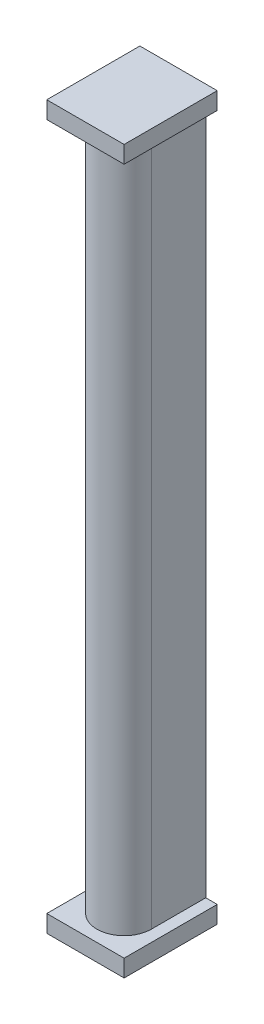
ISO-10303-21;
HEADER;
FILE_DESCRIPTION(('STEP AP214'),'2;1');
FILE_NAME('part.step','',(''),(''),'','','');
FILE_SCHEMA(('AUTOMOTIVE_DESIGN { 1 0 10303 214 1 1 1 1 }'));
ENDSEC;
DATA;
#1=APPLICATION_CONTEXT('core data for automotive mechanical design processes');
#2=APPLICATION_PROTOCOL_DEFINITION('international standard','automotive_design',2000,#1);
#3=PRODUCT_CONTEXT('',#1,'mechanical');
#4=PRODUCT('Part','Part','',(#3));
#5=PRODUCT_RELATED_PRODUCT_CATEGORY('part','',(#4));
#6=PRODUCT_DEFINITION_FORMATION('','',#4);
#7=PRODUCT_DEFINITION_CONTEXT('part definition',#1,'design');
#8=PRODUCT_DEFINITION('design','',#6,#7);
#9=PRODUCT_DEFINITION_SHAPE('','',#8);
#10=(LENGTH_UNIT() NAMED_UNIT(*) SI_UNIT(.MILLI.,.METRE.));
#11=(NAMED_UNIT(*) PLANE_ANGLE_UNIT() SI_UNIT($,.RADIAN.));
#12=(NAMED_UNIT(*) SI_UNIT($,.STERADIAN.) SOLID_ANGLE_UNIT());
#13=UNCERTAINTY_MEASURE_WITH_UNIT(LENGTH_MEASURE(1.E-05),#10,'distance_accuracy_value','');
#14=(GEOMETRIC_REPRESENTATION_CONTEXT(3) GLOBAL_UNCERTAINTY_ASSIGNED_CONTEXT((#13)) GLOBAL_UNIT_ASSIGNED_CONTEXT((#10,
#11,#12)) REPRESENTATION_CONTEXT('',''));
#15=CARTESIAN_POINT('',(0.,0.,0.));
#16=DIRECTION('',(0.,0.,1.));
#17=DIRECTION('',(1.,0.,0.));
#18=AXIS2_PLACEMENT_3D('',#15,#16,#17);
#19=CARTESIAN_POINT('',(0.,-120.,0.));
#20=DIRECTION('',(-1.,0.,0.));
#21=DIRECTION('',(0.,0.,1.));
#22=AXIS2_PLACEMENT_3D('',#19,#20,#21);
#23=PLANE('',#22);
#24=DIRECTION('',(0.,0.,1.));
#25=VECTOR('',#24,1.);
#26=CARTESIAN_POINT('',(0.,0.,0.));
#27=LINE('',#26,#25);
#28=CARTESIAN_POINT('',(0.,0.,0.));
#29=VERTEX_POINT('',#28);
#30=CARTESIAN_POINT('',(0.,0.,9.5));
#31=VERTEX_POINT('',#30);
#32=EDGE_CURVE('E88',#29,#31,#27,.T.);
#33=ORIENTED_EDGE('',*,*,#32,.F.);
#34=DIRECTION('',(0.,1.,0.));
#35=VECTOR('',#34,1.);
#36=CARTESIAN_POINT('',(0.,-120.,0.));
#37=LINE('',#36,#35);
#38=CARTESIAN_POINT('',(0.,-120.,0.));
#39=VERTEX_POINT('',#38);
#40=EDGE_CURVE('E11',#39,#29,#37,.T.);
#41=ORIENTED_EDGE('',*,*,#40,.F.);
#42=DIRECTION('',(0.,0.,1.));
#43=VECTOR('',#42,1.);
#44=CARTESIAN_POINT('',(0.,-120.,0.));
#45=LINE('',#44,#43);
#46=CARTESIAN_POINT('',(0.,-120.,9.5));
#47=VERTEX_POINT('',#46);
#48=EDGE_CURVE('E83',#39,#47,#45,.T.);
#49=ORIENTED_EDGE('',*,*,#48,.T.);
#50=DIRECTION('',(0.,1.,0.));
#51=VECTOR('',#50,1.);
#52=CARTESIAN_POINT('',(0.,-120.,9.5));
#53=LINE('',#52,#51);
#54=EDGE_CURVE('E72',#47,#31,#53,.T.);
#55=ORIENTED_EDGE('',*,*,#54,.T.);
#56=EDGE_LOOP('',(#33,#41,#49,#55));
#57=FACE_BOUND('',#56,.T.);
#58=ADVANCED_FACE('F33',(#57),#23,.T.);
#59=CARTESIAN_POINT('',(0.,-120.,0.));
#60=DIRECTION('',(0.,0.,-1.));
#61=DIRECTION('',(-1.,0.,0.));
#62=AXIS2_PLACEMENT_3D('',#59,#60,#61);
#63=PLANE('',#62);
#64=ORIENTED_EDGE('',*,*,#40,.T.);
#65=DIRECTION('',(-1.,0.,0.));
#66=VECTOR('',#65,1.);
#67=CARTESIAN_POINT('',(-2.,0.,0.));
#68=LINE('',#67,#66);
#69=CARTESIAN_POINT('',(-2.,0.,0.));
#70=VERTEX_POINT('',#69);
#71=EDGE_CURVE('E202',#29,#70,#68,.T.);
#72=ORIENTED_EDGE('',*,*,#71,.T.);
#73=DIRECTION('',(0.,-1.,0.));
#74=VECTOR('',#73,1.);
#75=CARTESIAN_POINT('',(-2.,3.,0.));
#76=LINE('',#75,#74);
#77=CARTESIAN_POINT('',(-2.,3.,0.));
#78=VERTEX_POINT('',#77);
#79=EDGE_CURVE('E209',#78,#70,#76,.T.);
#80=ORIENTED_EDGE('',*,*,#79,.F.);
#81=DIRECTION('',(-1.,0.,0.));
#82=VECTOR('',#81,1.);
#83=CARTESIAN_POINT('',(-2.,3.,0.));
#84=LINE('',#83,#82);
#85=CARTESIAN_POINT('',(11.5,3.,0.));
#86=VERTEX_POINT('',#85);
#87=EDGE_CURVE('E183',#86,#78,#84,.T.);
#88=ORIENTED_EDGE('',*,*,#87,.F.);
#89=DIRECTION('',(0.,-1.,0.));
#90=VECTOR('',#89,1.);
#91=CARTESIAN_POINT('',(11.5,3.,0.));
#92=LINE('',#91,#90);
#93=CARTESIAN_POINT('',(11.5,0.,0.));
#94=VERTEX_POINT('',#93);
#95=EDGE_CURVE('E196',#86,#94,#92,.T.);
#96=ORIENTED_EDGE('',*,*,#95,.T.);
#97=CARTESIAN_POINT('',(9.5,0.,0.));
#98=VERTEX_POINT('',#97);
#99=EDGE_CURVE('E187',#94,#98,#68,.T.);
#100=ORIENTED_EDGE('',*,*,#99,.T.);
#101=DIRECTION('',(0.,1.,0.));
#102=VECTOR('',#101,1.);
#103=CARTESIAN_POINT('',(9.5,-120.,0.));
#104=LINE('',#103,#102);
#105=CARTESIAN_POINT('',(9.5,-120.,0.));
#106=VERTEX_POINT('',#105);
#107=EDGE_CURVE('E42',#106,#98,#104,.T.);
#108=ORIENTED_EDGE('',*,*,#107,.F.);
#109=DIRECTION('',(1.,0.,0.));
#110=VECTOR('',#109,1.);
#111=CARTESIAN_POINT('',(-2.,-120.,0.));
#112=LINE('',#111,#110);
#113=CARTESIAN_POINT('',(11.5,-120.,0.));
#114=VERTEX_POINT('',#113);
#115=EDGE_CURVE('E114',#106,#114,#112,.T.);
#116=ORIENTED_EDGE('',*,*,#115,.T.);
#117=DIRECTION('',(0.,1.,0.));
#118=VECTOR('',#117,1.);
#119=CARTESIAN_POINT('',(11.5,-123.,0.));
#120=LINE('',#119,#118);
#121=CARTESIAN_POINT('',(11.5,-123.,0.));
#122=VERTEX_POINT('',#121);
#123=EDGE_CURVE('E273',#122,#114,#120,.T.);
#124=ORIENTED_EDGE('',*,*,#123,.F.);
#125=DIRECTION('',(1.,0.,0.));
#126=VECTOR('',#125,1.);
#127=CARTESIAN_POINT('',(-2.,-123.,0.));
#128=LINE('',#127,#126);
#129=CARTESIAN_POINT('',(-2.,-123.,0.));
#130=VERTEX_POINT('',#129);
#131=EDGE_CURVE('E287',#130,#122,#128,.T.);
#132=ORIENTED_EDGE('',*,*,#131,.F.);
#133=DIRECTION('',(0.,1.,0.));
#134=VECTOR('',#133,1.);
#135=CARTESIAN_POINT('',(-2.,-123.,0.));
#136=LINE('',#135,#134);
#137=CARTESIAN_POINT('',(-2.,-120.,0.));
#138=VERTEX_POINT('',#137);
#139=EDGE_CURVE('E90',#130,#138,#136,.T.);
#140=ORIENTED_EDGE('',*,*,#139,.T.);
#141=EDGE_CURVE('E276',#138,#39,#112,.T.);
#142=ORIENTED_EDGE('',*,*,#141,.T.);
#143=EDGE_LOOP('',(#64,#72,#80,#88,#96,#100,#108,#116,#124,#132,#140,#142));
#144=FACE_BOUND('',#143,.T.);
#145=ADVANCED_FACE('F214',(#144),#63,.T.);
#146=CARTESIAN_POINT('',(9.5,-120.,0.));
#147=DIRECTION('',(1.,0.,0.));
#148=DIRECTION('',(0.,0.,-1.));
#149=AXIS2_PLACEMENT_3D('',#146,#147,#148);
#150=PLANE('',#149);
#151=DIRECTION('',(0.,0.,-1.));
#152=VECTOR('',#151,1.);
#153=CARTESIAN_POINT('',(9.5,0.,0.));
#154=LINE('',#153,#152);
#155=CARTESIAN_POINT('',(9.5,0.,9.5));
#156=VERTEX_POINT('',#155);
#157=EDGE_CURVE('E76',#156,#98,#154,.T.);
#158=ORIENTED_EDGE('',*,*,#157,.F.);
#159=DIRECTION('',(0.,1.,0.));
#160=VECTOR('',#159,1.);
#161=CARTESIAN_POINT('',(9.5,-120.,9.5));
#162=LINE('',#161,#160);
#163=CARTESIAN_POINT('',(9.5,-120.,9.5));
#164=VERTEX_POINT('',#163);
#165=EDGE_CURVE('E63',#164,#156,#162,.T.);
#166=ORIENTED_EDGE('',*,*,#165,.F.);
#167=DIRECTION('',(0.,0.,-1.));
#168=VECTOR('',#167,1.);
#169=CARTESIAN_POINT('',(9.5,-120.,0.));
#170=LINE('',#169,#168);
#171=EDGE_CURVE('E50',#164,#106,#170,.T.);
#172=ORIENTED_EDGE('',*,*,#171,.T.);
#173=ORIENTED_EDGE('',*,*,#107,.T.);
#174=EDGE_LOOP('',(#158,#166,#172,#173));
#175=FACE_BOUND('',#174,.T.);
#176=ADVANCED_FACE('F77',(#175),#150,.T.);
#177=CARTESIAN_POINT('',(4.75,-120.,9.5));
#178=DIRECTION('',(0.,1.,0.));
#179=DIRECTION('',(0.,0.,1.));
#180=AXIS2_PLACEMENT_3D('',#177,#178,#179);
#181=CYLINDRICAL_SURFACE('',#180,4.75);
#182=CARTESIAN_POINT('',(4.75,0.,9.5));
#183=DIRECTION('',(0.,1.,0.));
#184=DIRECTION('',(0.,0.,1.));
#185=AXIS2_PLACEMENT_3D('',#182,#183,#184);
#186=CIRCLE('',#185,4.75);
#187=EDGE_CURVE('E68',#31,#156,#186,.T.);
#188=ORIENTED_EDGE('',*,*,#187,.F.);
#189=ORIENTED_EDGE('',*,*,#54,.F.);
#190=CARTESIAN_POINT('',(4.75,-120.,9.5));
#191=DIRECTION('',(0.,1.,0.));
#192=DIRECTION('',(0.,0.,1.));
#193=AXIS2_PLACEMENT_3D('',#190,#191,#192);
#194=CIRCLE('',#193,4.75);
#195=EDGE_CURVE('E70',#47,#164,#194,.T.);
#196=ORIENTED_EDGE('',*,*,#195,.T.);
#197=ORIENTED_EDGE('',*,*,#165,.T.);
#198=EDGE_LOOP('',(#188,#189,#196,#197));
#199=FACE_BOUND('',#198,.T.);
#200=ADVANCED_FACE('F65',(#199),#181,.T.);
#201=CARTESIAN_POINT('',(0.,-120.,0.));
#202=DIRECTION('',(0.,1.,0.));
#203=DIRECTION('',(0.,0.,1.));
#204=AXIS2_PLACEMENT_3D('',#201,#202,#203);
#205=PLANE('',#204);
#206=ORIENTED_EDGE('',*,*,#48,.F.);
#207=ORIENTED_EDGE('',*,*,#141,.F.);
#208=DIRECTION('',(0.,0.,-1.));
#209=VECTOR('',#208,1.);
#210=CARTESIAN_POINT('',(-2.,-120.,0.));
#211=LINE('',#210,#209);
#212=CARTESIAN_POINT('',(-2.,-120.,16.25));
#213=VERTEX_POINT('',#212);
#214=EDGE_CURVE('E192',#213,#138,#211,.T.);
#215=ORIENTED_EDGE('',*,*,#214,.F.);
#216=DIRECTION('',(-1.,0.,0.));
#217=VECTOR('',#216,1.);
#218=CARTESIAN_POINT('',(-2.,-120.,16.25));
#219=LINE('',#218,#217);
#220=CARTESIAN_POINT('',(11.5,-120.,16.25));
#221=VERTEX_POINT('',#220);
#222=EDGE_CURVE('E275',#221,#213,#219,.T.);
#223=ORIENTED_EDGE('',*,*,#222,.F.);
#224=DIRECTION('',(0.,0.,1.));
#225=VECTOR('',#224,1.);
#226=CARTESIAN_POINT('',(11.5,-120.,0.));
#227=LINE('',#226,#225);
#228=EDGE_CURVE('E267',#114,#221,#227,.T.);
#229=ORIENTED_EDGE('',*,*,#228,.F.);
#230=ORIENTED_EDGE('',*,*,#115,.F.);
#231=ORIENTED_EDGE('',*,*,#171,.F.);
#232=ORIENTED_EDGE('',*,*,#195,.F.);
#233=EDGE_LOOP('',(#206,#207,#215,#223,#229,#230,#231,#232));
#234=FACE_BOUND('',#233,.T.);
#235=ADVANCED_FACE('F244',(#234),#205,.T.);
#236=CARTESIAN_POINT('',(-2.,-123.,0.));
#237=DIRECTION('',(1.,0.,0.));
#238=DIRECTION('',(0.,0.,-1.));
#239=AXIS2_PLACEMENT_3D('',#236,#237,#238);
#240=PLANE('',#239);
#241=ORIENTED_EDGE('',*,*,#214,.T.);
#242=ORIENTED_EDGE('',*,*,#139,.F.);
#243=DIRECTION('',(0.,0.,-1.));
#244=VECTOR('',#243,1.);
#245=CARTESIAN_POINT('',(-2.,-123.,0.));
#246=LINE('',#245,#244);
#247=CARTESIAN_POINT('',(-2.,-123.,16.25));
#248=VERTEX_POINT('',#247);
#249=EDGE_CURVE('E284',#248,#130,#246,.T.);
#250=ORIENTED_EDGE('',*,*,#249,.F.);
#251=DIRECTION('',(0.,1.,0.));
#252=VECTOR('',#251,1.);
#253=CARTESIAN_POINT('',(-2.,-123.,16.25));
#254=LINE('',#253,#252);
#255=EDGE_CURVE('E281',#248,#213,#254,.T.);
#256=ORIENTED_EDGE('',*,*,#255,.T.);
#257=EDGE_LOOP('',(#241,#242,#250,#256));
#258=FACE_BOUND('',#257,.T.);
#259=ADVANCED_FACE('F241',(#258),#240,.F.);
#260=CARTESIAN_POINT('',(11.5,-123.,0.));
#261=DIRECTION('',(-1.,0.,0.));
#262=DIRECTION('',(0.,0.,1.));
#263=AXIS2_PLACEMENT_3D('',#260,#261,#262);
#264=PLANE('',#263);
#265=ORIENTED_EDGE('',*,*,#228,.T.);
#266=DIRECTION('',(0.,1.,0.));
#267=VECTOR('',#266,1.);
#268=CARTESIAN_POINT('',(11.5,-123.,16.25));
#269=LINE('',#268,#267);
#270=CARTESIAN_POINT('',(11.5,-123.,16.25));
#271=VERTEX_POINT('',#270);
#272=EDGE_CURVE('E270',#271,#221,#269,.T.);
#273=ORIENTED_EDGE('',*,*,#272,.F.);
#274=DIRECTION('',(0.,0.,1.));
#275=VECTOR('',#274,1.);
#276=CARTESIAN_POINT('',(11.5,-123.,0.));
#277=LINE('',#276,#275);
#278=EDGE_CURVE('E300',#122,#271,#277,.T.);
#279=ORIENTED_EDGE('',*,*,#278,.F.);
#280=ORIENTED_EDGE('',*,*,#123,.T.);
#281=EDGE_LOOP('',(#265,#273,#279,#280));
#282=FACE_BOUND('',#281,.T.);
#283=ADVANCED_FACE('F252',(#282),#264,.F.);
#284=CARTESIAN_POINT('',(-2.,-123.,16.25));
#285=DIRECTION('',(0.,0.,-1.));
#286=DIRECTION('',(-1.,0.,0.));
#287=AXIS2_PLACEMENT_3D('',#284,#285,#286);
#288=PLANE('',#287);
#289=ORIENTED_EDGE('',*,*,#222,.T.);
#290=ORIENTED_EDGE('',*,*,#255,.F.);
#291=DIRECTION('',(-1.,0.,0.));
#292=VECTOR('',#291,1.);
#293=CARTESIAN_POINT('',(-2.,-123.,16.25));
#294=LINE('',#293,#292);
#295=EDGE_CURVE('E280',#271,#248,#294,.T.);
#296=ORIENTED_EDGE('',*,*,#295,.F.);
#297=ORIENTED_EDGE('',*,*,#272,.T.);
#298=EDGE_LOOP('',(#289,#290,#296,#297));
#299=FACE_BOUND('',#298,.T.);
#300=ADVANCED_FACE('F258',(#299),#288,.F.);
#301=CARTESIAN_POINT('',(0.,-123.,0.));
#302=DIRECTION('',(0.,1.,0.));
#303=DIRECTION('',(0.,0.,1.));
#304=AXIS2_PLACEMENT_3D('',#301,#302,#303);
#305=PLANE('',#304);
#306=ORIENTED_EDGE('',*,*,#249,.T.);
#307=ORIENTED_EDGE('',*,*,#131,.T.);
#308=ORIENTED_EDGE('',*,*,#278,.T.);
#309=ORIENTED_EDGE('',*,*,#295,.T.);
#310=EDGE_LOOP('',(#306,#307,#308,#309));
#311=FACE_BOUND('',#310,.T.);
#312=ADVANCED_FACE('F256',(#311),#305,.F.);
#313=CARTESIAN_POINT('',(0.,0.,0.));
#314=DIRECTION('',(0.,1.,0.));
#315=DIRECTION('',(0.,0.,1.));
#316=AXIS2_PLACEMENT_3D('',#313,#314,#315);
#317=PLANE('',#316);
#318=ORIENTED_EDGE('',*,*,#71,.F.);
#319=ORIENTED_EDGE('',*,*,#32,.T.);
#320=ORIENTED_EDGE('',*,*,#187,.T.);
#321=ORIENTED_EDGE('',*,*,#157,.T.);
#322=ORIENTED_EDGE('',*,*,#99,.F.);
#323=DIRECTION('',(0.,0.,-1.));
#324=VECTOR('',#323,1.);
#325=CARTESIAN_POINT('',(11.5,0.,0.));
#326=LINE('',#325,#324);
#327=CARTESIAN_POINT('',(11.5,0.,16.25));
#328=VERTEX_POINT('',#327);
#329=EDGE_CURVE('E207',#328,#94,#326,.T.);
#330=ORIENTED_EDGE('',*,*,#329,.F.);
#331=DIRECTION('',(1.,0.,0.));
#332=VECTOR('',#331,1.);
#333=CARTESIAN_POINT('',(-2.,0.,16.25));
#334=LINE('',#333,#332);
#335=CARTESIAN_POINT('',(-2.,0.,16.25));
#336=VERTEX_POINT('',#335);
#337=EDGE_CURVE('E217',#336,#328,#334,.T.);
#338=ORIENTED_EDGE('',*,*,#337,.F.);
#339=DIRECTION('',(0.,0.,1.));
#340=VECTOR('',#339,1.);
#341=CARTESIAN_POINT('',(-2.,0.,0.));
#342=LINE('',#341,#340);
#343=EDGE_CURVE('E191',#70,#336,#342,.T.);
#344=ORIENTED_EDGE('',*,*,#343,.F.);
#345=EDGE_LOOP('',(#318,#319,#320,#321,#322,#330,#338,#344));
#346=FACE_BOUND('',#345,.T.);
#347=ADVANCED_FACE('F86',(#346),#317,.F.);
#348=CARTESIAN_POINT('',(-2.,3.,0.));
#349=DIRECTION('',(1.,0.,0.));
#350=DIRECTION('',(0.,0.,-1.));
#351=AXIS2_PLACEMENT_3D('',#348,#349,#350);
#352=PLANE('',#351);
#353=ORIENTED_EDGE('',*,*,#343,.T.);
#354=DIRECTION('',(0.,-1.,0.));
#355=VECTOR('',#354,1.);
#356=CARTESIAN_POINT('',(-2.,3.,16.25));
#357=LINE('',#356,#355);
#358=CARTESIAN_POINT('',(-2.,3.,16.25));
#359=VERTEX_POINT('',#358);
#360=EDGE_CURVE('E171',#359,#336,#357,.T.);
#361=ORIENTED_EDGE('',*,*,#360,.F.);
#362=DIRECTION('',(0.,0.,1.));
#363=VECTOR('',#362,1.);
#364=CARTESIAN_POINT('',(-2.,3.,0.));
#365=LINE('',#364,#363);
#366=EDGE_CURVE('E178',#78,#359,#365,.T.);
#367=ORIENTED_EDGE('',*,*,#366,.F.);
#368=ORIENTED_EDGE('',*,*,#79,.T.);
#369=EDGE_LOOP('',(#353,#361,#367,#368));
#370=FACE_BOUND('',#369,.T.);
#371=ADVANCED_FACE('F189',(#370),#352,.F.);
#372=CARTESIAN_POINT('',(-2.,3.,16.25));
#373=DIRECTION('',(0.,0.,-1.));
#374=DIRECTION('',(-1.,0.,0.));
#375=AXIS2_PLACEMENT_3D('',#372,#373,#374);
#376=PLANE('',#375);
#377=ORIENTED_EDGE('',*,*,#337,.T.);
#378=DIRECTION('',(0.,-1.,0.));
#379=VECTOR('',#378,1.);
#380=CARTESIAN_POINT('',(11.5,3.,16.25));
#381=LINE('',#380,#379);
#382=CARTESIAN_POINT('',(11.5,3.,16.25));
#383=VERTEX_POINT('',#382);
#384=EDGE_CURVE('E174',#383,#328,#381,.T.);
#385=ORIENTED_EDGE('',*,*,#384,.F.);
#386=DIRECTION('',(1.,0.,0.));
#387=VECTOR('',#386,1.);
#388=CARTESIAN_POINT('',(-2.,3.,16.25));
#389=LINE('',#388,#387);
#390=EDGE_CURVE('E167',#359,#383,#389,.T.);
#391=ORIENTED_EDGE('',*,*,#390,.F.);
#392=ORIENTED_EDGE('',*,*,#360,.T.);
#393=EDGE_LOOP('',(#377,#385,#391,#392));
#394=FACE_BOUND('',#393,.T.);
#395=ADVANCED_FACE('F169',(#394),#376,.F.);
#396=CARTESIAN_POINT('',(11.5,3.,0.));
#397=DIRECTION('',(-1.,0.,0.));
#398=DIRECTION('',(0.,0.,1.));
#399=AXIS2_PLACEMENT_3D('',#396,#397,#398);
#400=PLANE('',#399);
#401=ORIENTED_EDGE('',*,*,#329,.T.);
#402=ORIENTED_EDGE('',*,*,#95,.F.);
#403=DIRECTION('',(0.,0.,-1.));
#404=VECTOR('',#403,1.);
#405=CARTESIAN_POINT('',(11.5,3.,0.));
#406=LINE('',#405,#404);
#407=EDGE_CURVE('E177',#383,#86,#406,.T.);
#408=ORIENTED_EDGE('',*,*,#407,.F.);
#409=ORIENTED_EDGE('',*,*,#384,.T.);
#410=EDGE_LOOP('',(#401,#402,#408,#409));
#411=FACE_BOUND('',#410,.T.);
#412=ADVANCED_FACE('F221',(#411),#400,.F.);
#413=CARTESIAN_POINT('',(0.,3.,0.));
#414=DIRECTION('',(0.,1.,0.));
#415=DIRECTION('',(0.,0.,1.));
#416=AXIS2_PLACEMENT_3D('',#413,#414,#415);
#417=PLANE('',#416);
#418=ORIENTED_EDGE('',*,*,#366,.T.);
#419=ORIENTED_EDGE('',*,*,#390,.T.);
#420=ORIENTED_EDGE('',*,*,#407,.T.);
#421=ORIENTED_EDGE('',*,*,#87,.T.);
#422=EDGE_LOOP('',(#418,#419,#420,#421));
#423=FACE_BOUND('',#422,.T.);
#424=ADVANCED_FACE('F181',(#423),#417,.T.);
#425=CLOSED_SHELL('',(#58,#145,#176,#200,#235,#259,#283,#300,#312,#347,#371,#395,#412,#424));
#426=MANIFOLD_SOLID_BREP('B2',#425);
#427=ADVANCED_BREP_SHAPE_REPRESENTATION('',(#18,#426),#14);
#428=SHAPE_DEFINITION_REPRESENTATION(#9,#427);
ENDSEC;
END-ISO-10303-21;
